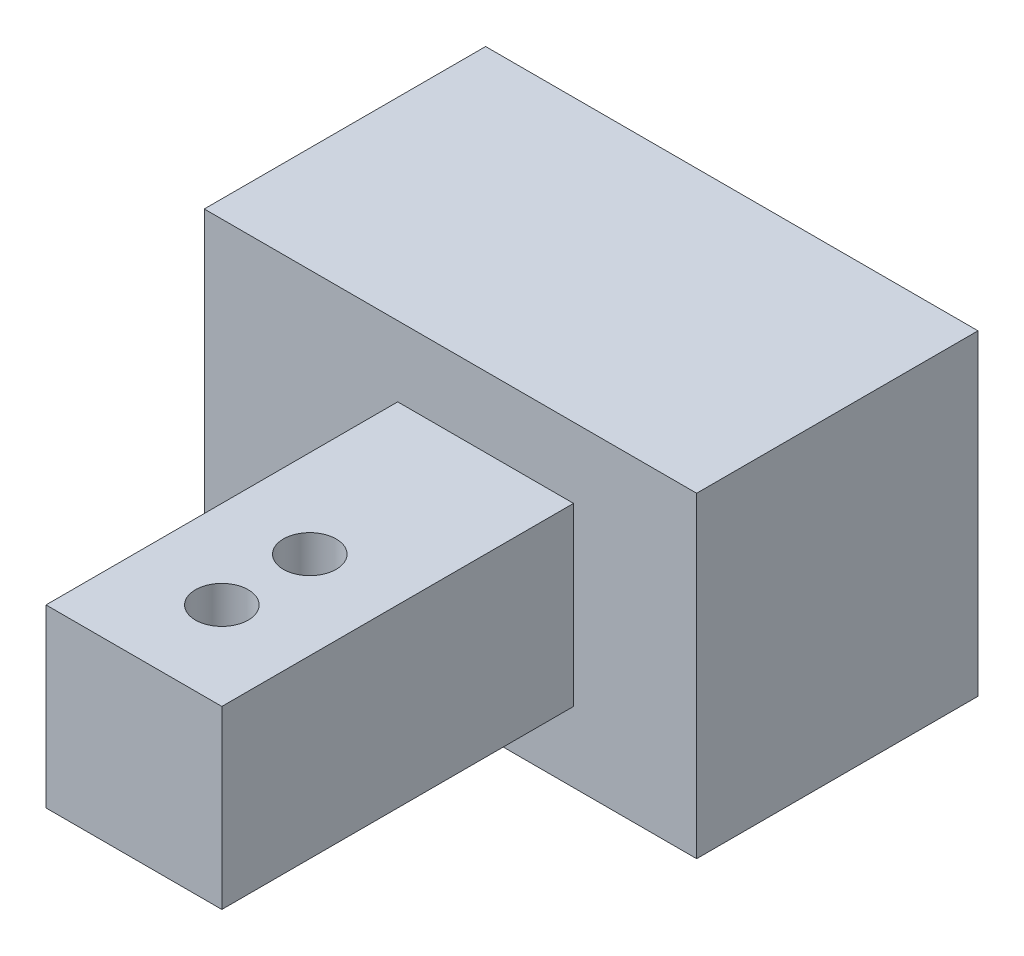
ISO-10303-21;
HEADER;
FILE_DESCRIPTION(('STEP AP214'),'2;1');
FILE_NAME('part.step','',(''),(''),'','','');
FILE_SCHEMA(('AUTOMOTIVE_DESIGN { 1 0 10303 214 1 1 1 1 }'));
ENDSEC;
DATA;
#1=APPLICATION_CONTEXT('core data for automotive mechanical design processes');
#2=APPLICATION_PROTOCOL_DEFINITION('international standard','automotive_design',2000,#1);
#3=PRODUCT_CONTEXT('',#1,'mechanical');
#4=PRODUCT('Part','Part','',(#3));
#5=PRODUCT_RELATED_PRODUCT_CATEGORY('part','',(#4));
#6=PRODUCT_DEFINITION_FORMATION('','',#4);
#7=PRODUCT_DEFINITION_CONTEXT('part definition',#1,'design');
#8=PRODUCT_DEFINITION('design','',#6,#7);
#9=PRODUCT_DEFINITION_SHAPE('','',#8);
#10=(LENGTH_UNIT() NAMED_UNIT(*) SI_UNIT(.MILLI.,.METRE.));
#11=(NAMED_UNIT(*) PLANE_ANGLE_UNIT() SI_UNIT($,.RADIAN.));
#12=(NAMED_UNIT(*) SI_UNIT($,.STERADIAN.) SOLID_ANGLE_UNIT());
#13=UNCERTAINTY_MEASURE_WITH_UNIT(LENGTH_MEASURE(1.E-05),#10,'distance_accuracy_value','');
#14=(GEOMETRIC_REPRESENTATION_CONTEXT(3) GLOBAL_UNCERTAINTY_ASSIGNED_CONTEXT((#13)) GLOBAL_UNIT_ASSIGNED_CONTEXT((#10,
#11,#12)) REPRESENTATION_CONTEXT('',''));
#15=CARTESIAN_POINT('',(0.,0.,0.));
#16=DIRECTION('',(0.,0.,1.));
#17=DIRECTION('',(1.,0.,0.));
#18=AXIS2_PLACEMENT_3D('',#15,#16,#17);
#19=CARTESIAN_POINT('',(-13.5384615384615,18.,10.6461538461538));
#20=DIRECTION('',(0.,0.,-1.));
#21=DIRECTION('',(-1.,0.,0.));
#22=AXIS2_PLACEMENT_3D('',#19,#20,#21);
#23=PLANE('',#22);
#24=DIRECTION('',(1.,0.,0.));
#25=VECTOR('',#24,1.);
#26=CARTESIAN_POINT('',(-13.5384615384615,0.,10.6461538461538));
#27=LINE('',#26,#25);
#28=CARTESIAN_POINT('',(-13.5384615384615,0.,10.6461538461538));
#29=VERTEX_POINT('',#28);
#30=CARTESIAN_POINT('',(14.4615384615385,0.,10.6461538461538));
#31=VERTEX_POINT('',#30);
#32=EDGE_CURVE('E216',#29,#31,#27,.T.);
#33=ORIENTED_EDGE('',*,*,#32,.T.);
#34=DIRECTION('',(0.,-1.,0.));
#35=VECTOR('',#34,1.);
#36=CARTESIAN_POINT('',(14.4615384615385,18.,10.6461538461538));
#37=LINE('',#36,#35);
#38=CARTESIAN_POINT('',(14.4615384615385,18.,10.6461538461538));
#39=VERTEX_POINT('',#38);
#40=EDGE_CURVE('E41',#39,#31,#37,.T.);
#41=ORIENTED_EDGE('',*,*,#40,.F.);
#42=DIRECTION('',(1.,0.,0.));
#43=VECTOR('',#42,1.);
#44=CARTESIAN_POINT('',(-13.5384615384615,18.,10.6461538461538));
#45=LINE('',#44,#43);
#46=CARTESIAN_POINT('',(-13.5384615384615,18.,10.6461538461538));
#47=VERTEX_POINT('',#46);
#48=EDGE_CURVE('E206',#47,#39,#45,.T.);
#49=ORIENTED_EDGE('',*,*,#48,.F.);
#50=DIRECTION('',(0.,-1.,0.));
#51=VECTOR('',#50,1.);
#52=CARTESIAN_POINT('',(-13.5384615384615,18.,10.6461538461538));
#53=LINE('',#52,#51);
#54=EDGE_CURVE('E11',#47,#29,#53,.T.);
#55=ORIENTED_EDGE('',*,*,#54,.T.);
#56=EDGE_LOOP('',(#33,#41,#49,#55));
#57=FACE_BOUND('',#56,.T.);
#58=DIRECTION('',(0.,-1.,0.));
#59=VECTOR('',#58,1.);
#60=CARTESIAN_POINT('',(-2.53846153846153,14.,10.6461538461538));
#61=LINE('',#60,#59);
#62=CARTESIAN_POINT('',(-2.53846153846153,14.,10.6461538461538));
#63=VERTEX_POINT('',#62);
#64=CARTESIAN_POINT('',(-2.53846153846153,4.,10.6461538461538));
#65=VERTEX_POINT('',#64);
#66=EDGE_CURVE('E172',#63,#65,#61,.T.);
#67=ORIENTED_EDGE('',*,*,#66,.F.);
#68=DIRECTION('',(-1.,0.,0.));
#69=VECTOR('',#68,1.);
#70=CARTESIAN_POINT('',(-2.53846153846153,14.,10.6461538461538));
#71=LINE('',#70,#69);
#72=CARTESIAN_POINT('',(7.46153846153847,14.,10.6461538461538));
#73=VERTEX_POINT('',#72);
#74=EDGE_CURVE('E177',#73,#63,#71,.T.);
#75=ORIENTED_EDGE('',*,*,#74,.F.);
#76=DIRECTION('',(0.,1.,0.));
#77=VECTOR('',#76,1.);
#78=CARTESIAN_POINT('',(7.46153846153847,14.,10.6461538461538));
#79=LINE('',#78,#77);
#80=CARTESIAN_POINT('',(7.46153846153847,4.,10.6461538461538));
#81=VERTEX_POINT('',#80);
#82=EDGE_CURVE('E187',#81,#73,#79,.T.);
#83=ORIENTED_EDGE('',*,*,#82,.F.);
#84=DIRECTION('',(1.,0.,0.));
#85=VECTOR('',#84,1.);
#86=CARTESIAN_POINT('',(-2.53846153846153,4.,10.6461538461538));
#87=LINE('',#86,#85);
#88=EDGE_CURVE('E56',#65,#81,#87,.T.);
#89=ORIENTED_EDGE('',*,*,#88,.F.);
#90=EDGE_LOOP('',(#67,#75,#83,#89));
#91=FACE_BOUND('',#90,.T.);
#92=ADVANCED_FACE('F33',(#57,#91),#23,.F.);
#93=CARTESIAN_POINT('',(-13.5384615384615,18.,-5.35384615384615));
#94=DIRECTION('',(1.,0.,0.));
#95=DIRECTION('',(0.,0.,-1.));
#96=AXIS2_PLACEMENT_3D('',#93,#94,#95);
#97=PLANE('',#96);
#98=DIRECTION('',(0.,0.,1.));
#99=VECTOR('',#98,1.);
#100=CARTESIAN_POINT('',(-13.5384615384615,2.,-3.35384615384615));
#101=LINE('',#100,#99);
#102=CARTESIAN_POINT('',(-13.5384615384615,2.,-3.35384615384615));
#103=VERTEX_POINT('',#102);
#104=CARTESIAN_POINT('',(-13.5384615384615,2.,8.64615384615385));
#105=VERTEX_POINT('',#104);
#106=EDGE_CURVE('E151',#103,#105,#101,.T.);
#107=ORIENTED_EDGE('',*,*,#106,.F.);
#108=DIRECTION('',(0.,-1.,0.));
#109=VECTOR('',#108,1.);
#110=CARTESIAN_POINT('',(-13.5384615384615,16.,-3.35384615384615));
#111=LINE('',#110,#109);
#112=CARTESIAN_POINT('',(-13.5384615384615,16.,-3.35384615384615));
#113=VERTEX_POINT('',#112);
#114=EDGE_CURVE('E48',#113,#103,#111,.T.);
#115=ORIENTED_EDGE('',*,*,#114,.F.);
#116=DIRECTION('',(0.,0.,-1.));
#117=VECTOR('',#116,1.);
#118=CARTESIAN_POINT('',(-13.5384615384615,16.,-3.35384615384615));
#119=LINE('',#118,#117);
#120=CARTESIAN_POINT('',(-13.5384615384615,16.,8.64615384615385));
#121=VERTEX_POINT('',#120);
#122=EDGE_CURVE('E142',#121,#113,#119,.T.);
#123=ORIENTED_EDGE('',*,*,#122,.F.);
#124=DIRECTION('',(0.,1.,0.));
#125=VECTOR('',#124,1.);
#126=CARTESIAN_POINT('',(-13.5384615384615,16.,8.64615384615385));
#127=LINE('',#126,#125);
#128=EDGE_CURVE('E145',#105,#121,#127,.T.);
#129=ORIENTED_EDGE('',*,*,#128,.F.);
#130=EDGE_LOOP('',(#107,#115,#123,#129));
#131=FACE_BOUND('',#130,.T.);
#132=DIRECTION('',(0.,0.,1.));
#133=VECTOR('',#132,1.);
#134=CARTESIAN_POINT('',(-13.5384615384615,0.,-5.35384615384615));
#135=LINE('',#134,#133);
#136=CARTESIAN_POINT('',(-13.5384615384615,0.,-5.35384615384615));
#137=VERTEX_POINT('',#136);
#138=EDGE_CURVE('E202',#137,#29,#135,.T.);
#139=ORIENTED_EDGE('',*,*,#138,.T.);
#140=ORIENTED_EDGE('',*,*,#54,.F.);
#141=DIRECTION('',(0.,0.,1.));
#142=VECTOR('',#141,1.);
#143=CARTESIAN_POINT('',(-13.5384615384615,18.,-5.35384615384615));
#144=LINE('',#143,#142);
#145=CARTESIAN_POINT('',(-13.5384615384615,18.,-5.35384615384615));
#146=VERTEX_POINT('',#145);
#147=EDGE_CURVE('E203',#146,#47,#144,.T.);
#148=ORIENTED_EDGE('',*,*,#147,.F.);
#149=DIRECTION('',(0.,-1.,0.));
#150=VECTOR('',#149,1.);
#151=CARTESIAN_POINT('',(-13.5384615384615,18.,-5.35384615384615));
#152=LINE('',#151,#150);
#153=EDGE_CURVE('E213',#146,#137,#152,.T.);
#154=ORIENTED_EDGE('',*,*,#153,.T.);
#155=EDGE_LOOP('',(#139,#140,#148,#154));
#156=FACE_BOUND('',#155,.T.);
#157=ADVANCED_FACE('F35',(#131,#156),#97,.F.);
#158=CARTESIAN_POINT('',(14.4615384615385,18.,-5.35384615384615));
#159=DIRECTION('',(-1.,0.,0.));
#160=DIRECTION('',(0.,0.,1.));
#161=AXIS2_PLACEMENT_3D('',#158,#159,#160);
#162=PLANE('',#161);
#163=DIRECTION('',(0.,0.,-1.));
#164=VECTOR('',#163,1.);
#165=CARTESIAN_POINT('',(14.4615384615385,0.,-5.35384615384615));
#166=LINE('',#165,#164);
#167=CARTESIAN_POINT('',(14.4615384615385,0.,-5.35384615384615));
#168=VERTEX_POINT('',#167);
#169=EDGE_CURVE('E218',#31,#168,#166,.T.);
#170=ORIENTED_EDGE('',*,*,#169,.T.);
#171=DIRECTION('',(0.,-1.,0.));
#172=VECTOR('',#171,1.);
#173=CARTESIAN_POINT('',(14.4615384615385,18.,-5.35384615384615));
#174=LINE('',#173,#172);
#175=CARTESIAN_POINT('',(14.4615384615385,18.,-5.35384615384615));
#176=VERTEX_POINT('',#175);
#177=EDGE_CURVE('E223',#176,#168,#174,.T.);
#178=ORIENTED_EDGE('',*,*,#177,.F.);
#179=DIRECTION('',(0.,0.,-1.));
#180=VECTOR('',#179,1.);
#181=CARTESIAN_POINT('',(14.4615384615385,18.,-5.35384615384615));
#182=LINE('',#181,#180);
#183=EDGE_CURVE('E209',#39,#176,#182,.T.);
#184=ORIENTED_EDGE('',*,*,#183,.F.);
#185=ORIENTED_EDGE('',*,*,#40,.T.);
#186=EDGE_LOOP('',(#170,#178,#184,#185));
#187=FACE_BOUND('',#186,.T.);
#188=ADVANCED_FACE('F230',(#187),#162,.F.);
#189=CARTESIAN_POINT('',(-13.5384615384615,18.,-5.35384615384615));
#190=DIRECTION('',(0.,0.,1.));
#191=DIRECTION('',(1.,0.,0.));
#192=AXIS2_PLACEMENT_3D('',#189,#190,#191);
#193=PLANE('',#192);
#194=DIRECTION('',(-1.,0.,0.));
#195=VECTOR('',#194,1.);
#196=CARTESIAN_POINT('',(-13.5384615384615,0.,-5.35384615384615));
#197=LINE('',#196,#195);
#198=EDGE_CURVE('E207',#168,#137,#197,.T.);
#199=ORIENTED_EDGE('',*,*,#198,.T.);
#200=ORIENTED_EDGE('',*,*,#153,.F.);
#201=DIRECTION('',(-1.,0.,0.));
#202=VECTOR('',#201,1.);
#203=CARTESIAN_POINT('',(-13.5384615384615,18.,-5.35384615384615));
#204=LINE('',#203,#202);
#205=EDGE_CURVE('E211',#176,#146,#204,.T.);
#206=ORIENTED_EDGE('',*,*,#205,.F.);
#207=ORIENTED_EDGE('',*,*,#177,.T.);
#208=EDGE_LOOP('',(#199,#200,#206,#207));
#209=FACE_BOUND('',#208,.T.);
#210=ADVANCED_FACE('F239',(#209),#193,.F.);
#211=CARTESIAN_POINT('',(0.,18.,0.));
#212=DIRECTION('',(0.,1.,0.));
#213=DIRECTION('',(0.,0.,1.));
#214=AXIS2_PLACEMENT_3D('',#211,#212,#213);
#215=PLANE('',#214);
#216=ORIENTED_EDGE('',*,*,#147,.T.);
#217=ORIENTED_EDGE('',*,*,#48,.T.);
#218=ORIENTED_EDGE('',*,*,#183,.T.);
#219=ORIENTED_EDGE('',*,*,#205,.T.);
#220=EDGE_LOOP('',(#216,#217,#218,#219));
#221=FACE_BOUND('',#220,.T.);
#222=ADVANCED_FACE('F245',(#221),#215,.T.);
#223=CARTESIAN_POINT('',(0.,0.,0.));
#224=DIRECTION('',(0.,1.,0.));
#225=DIRECTION('',(0.,0.,1.));
#226=AXIS2_PLACEMENT_3D('',#223,#224,#225);
#227=PLANE('',#226);
#228=ORIENTED_EDGE('',*,*,#138,.F.);
#229=ORIENTED_EDGE('',*,*,#198,.F.);
#230=ORIENTED_EDGE('',*,*,#169,.F.);
#231=ORIENTED_EDGE('',*,*,#32,.F.);
#232=EDGE_LOOP('',(#228,#229,#230,#231));
#233=FACE_BOUND('',#232,.T.);
#234=ADVANCED_FACE('F236',(#233),#227,.F.);
#235=CARTESIAN_POINT('',(-2.53846153846153,14.,30.6461538461539));
#236=DIRECTION('',(1.,0.,0.));
#237=DIRECTION('',(0.,1.,0.));
#238=AXIS2_PLACEMENT_3D('',#235,#236,#237);
#239=PLANE('',#238);
#240=ORIENTED_EDGE('',*,*,#66,.T.);
#241=DIRECTION('',(0.,0.,-1.));
#242=VECTOR('',#241,1.);
#243=CARTESIAN_POINT('',(-2.53846153846153,4.,30.6461538461539));
#244=LINE('',#243,#242);
#245=CARTESIAN_POINT('',(-2.53846153846153,4.,30.6461538461539));
#246=VERTEX_POINT('',#245);
#247=EDGE_CURVE('E200',#246,#65,#244,.T.);
#248=ORIENTED_EDGE('',*,*,#247,.F.);
#249=DIRECTION('',(0.,-1.,0.));
#250=VECTOR('',#249,1.);
#251=CARTESIAN_POINT('',(-2.53846153846153,14.,30.6461538461539));
#252=LINE('',#251,#250);
#253=CARTESIAN_POINT('',(-2.53846153846153,14.,30.6461538461539));
#254=VERTEX_POINT('',#253);
#255=EDGE_CURVE('E173',#254,#246,#252,.T.);
#256=ORIENTED_EDGE('',*,*,#255,.F.);
#257=DIRECTION('',(0.,0.,-1.));
#258=VECTOR('',#257,1.);
#259=CARTESIAN_POINT('',(-2.53846153846153,14.,30.6461538461539));
#260=LINE('',#259,#258);
#261=EDGE_CURVE('E183',#254,#63,#260,.T.);
#262=ORIENTED_EDGE('',*,*,#261,.T.);
#263=EDGE_LOOP('',(#240,#248,#256,#262));
#264=FACE_BOUND('',#263,.T.);
#265=ADVANCED_FACE('F255',(#264),#239,.F.);
#266=CARTESIAN_POINT('',(-2.53846153846153,4.,30.6461538461539));
#267=DIRECTION('',(0.,1.,0.));
#268=DIRECTION('',(0.,0.,1.));
#269=AXIS2_PLACEMENT_3D('',#266,#267,#268);
#270=PLANE('',#269);
#271=CARTESIAN_POINT('',(2.46153846153847,4.,25.6461538461539));
#272=DIRECTION('',(0.,1.,0.));
#273=DIRECTION('',(0.,0.,1.));
#274=AXIS2_PLACEMENT_3D('',#271,#272,#273);
#275=CIRCLE('',#274,1.5);
#276=CARTESIAN_POINT('',(2.46153846153847,4.,27.1461538461539));
#277=VERTEX_POINT('',#276);
#278=EDGE_CURVE('E163',#277,#277,#275,.T.);
#279=ORIENTED_EDGE('',*,*,#278,.T.);
#280=EDGE_LOOP('',(#279));
#281=FACE_BOUND('',#280,.T.);
#282=CARTESIAN_POINT('',(2.46153846153847,4.,20.6461538461538));
#283=DIRECTION('',(0.,1.,0.));
#284=DIRECTION('',(0.,0.,1.));
#285=AXIS2_PLACEMENT_3D('',#282,#283,#284);
#286=CIRCLE('',#285,1.5);
#287=CARTESIAN_POINT('',(2.46153846153847,4.,22.1461538461539));
#288=VERTEX_POINT('',#287);
#289=EDGE_CURVE('E169',#288,#288,#286,.T.);
#290=ORIENTED_EDGE('',*,*,#289,.T.);
#291=EDGE_LOOP('',(#290));
#292=FACE_BOUND('',#291,.T.);
#293=ORIENTED_EDGE('',*,*,#88,.T.);
#294=DIRECTION('',(0.,0.,-1.));
#295=VECTOR('',#294,1.);
#296=CARTESIAN_POINT('',(7.46153846153847,4.,30.6461538461539));
#297=LINE('',#296,#295);
#298=CARTESIAN_POINT('',(7.46153846153847,4.,30.6461538461539));
#299=VERTEX_POINT('',#298);
#300=EDGE_CURVE('E197',#299,#81,#297,.T.);
#301=ORIENTED_EDGE('',*,*,#300,.F.);
#302=DIRECTION('',(1.,0.,0.));
#303=VECTOR('',#302,1.);
#304=CARTESIAN_POINT('',(-2.53846153846153,4.,30.6461538461539));
#305=LINE('',#304,#303);
#306=EDGE_CURVE('E176',#246,#299,#305,.T.);
#307=ORIENTED_EDGE('',*,*,#306,.F.);
#308=ORIENTED_EDGE('',*,*,#247,.T.);
#309=EDGE_LOOP('',(#293,#301,#307,#308));
#310=FACE_BOUND('',#309,.T.);
#311=ADVANCED_FACE('F263',(#281,#292,#310),#270,.F.);
#312=CARTESIAN_POINT('',(7.46153846153847,14.,30.6461538461539));
#313=DIRECTION('',(-1.,0.,0.));
#314=DIRECTION('',(0.,-1.,0.));
#315=AXIS2_PLACEMENT_3D('',#312,#313,#314);
#316=PLANE('',#315);
#317=ORIENTED_EDGE('',*,*,#82,.T.);
#318=DIRECTION('',(0.,0.,-1.));
#319=VECTOR('',#318,1.);
#320=CARTESIAN_POINT('',(7.46153846153847,14.,30.6461538461539));
#321=LINE('',#320,#319);
#322=CARTESIAN_POINT('',(7.46153846153847,14.,30.6461538461539));
#323=VERTEX_POINT('',#322);
#324=EDGE_CURVE('E194',#323,#73,#321,.T.);
#325=ORIENTED_EDGE('',*,*,#324,.F.);
#326=DIRECTION('',(0.,1.,0.));
#327=VECTOR('',#326,1.);
#328=CARTESIAN_POINT('',(7.46153846153847,14.,30.6461538461539));
#329=LINE('',#328,#327);
#330=EDGE_CURVE('E179',#299,#323,#329,.T.);
#331=ORIENTED_EDGE('',*,*,#330,.F.);
#332=ORIENTED_EDGE('',*,*,#300,.T.);
#333=EDGE_LOOP('',(#317,#325,#331,#332));
#334=FACE_BOUND('',#333,.T.);
#335=ADVANCED_FACE('F261',(#334),#316,.F.);
#336=CARTESIAN_POINT('',(-2.53846153846153,14.,30.6461538461539));
#337=DIRECTION('',(0.,-1.,0.));
#338=DIRECTION('',(0.,0.,-1.));
#339=AXIS2_PLACEMENT_3D('',#336,#337,#338);
#340=PLANE('',#339);
#341=CARTESIAN_POINT('',(2.46153846153847,14.,25.6461538461539));
#342=DIRECTION('',(0.,1.,0.));
#343=DIRECTION('',(0.,0.,1.));
#344=AXIS2_PLACEMENT_3D('',#341,#342,#343);
#345=CIRCLE('',#344,1.5);
#346=CARTESIAN_POINT('',(2.46153846153847,14.,27.1461538461539));
#347=VERTEX_POINT('',#346);
#348=EDGE_CURVE('E157',#347,#347,#345,.T.);
#349=ORIENTED_EDGE('',*,*,#348,.F.);
#350=EDGE_LOOP('',(#349));
#351=FACE_BOUND('',#350,.T.);
#352=CARTESIAN_POINT('',(2.46153846153847,14.,20.6461538461538));
#353=DIRECTION('',(0.,1.,0.));
#354=DIRECTION('',(0.,0.,1.));
#355=AXIS2_PLACEMENT_3D('',#352,#353,#354);
#356=CIRCLE('',#355,1.5);
#357=CARTESIAN_POINT('',(2.46153846153847,14.,22.1461538461539));
#358=VERTEX_POINT('',#357);
#359=EDGE_CURVE('E166',#358,#358,#356,.T.);
#360=ORIENTED_EDGE('',*,*,#359,.F.);
#361=EDGE_LOOP('',(#360));
#362=FACE_BOUND('',#361,.T.);
#363=ORIENTED_EDGE('',*,*,#74,.T.);
#364=ORIENTED_EDGE('',*,*,#261,.F.);
#365=DIRECTION('',(-1.,0.,0.));
#366=VECTOR('',#365,1.);
#367=CARTESIAN_POINT('',(-2.53846153846153,14.,30.6461538461539));
#368=LINE('',#367,#366);
#369=EDGE_CURVE('E181',#323,#254,#368,.T.);
#370=ORIENTED_EDGE('',*,*,#369,.F.);
#371=ORIENTED_EDGE('',*,*,#324,.T.);
#372=EDGE_LOOP('',(#363,#364,#370,#371));
#373=FACE_BOUND('',#372,.T.);
#374=ADVANCED_FACE('F251',(#351,#362,#373),#340,.F.);
#375=CARTESIAN_POINT('',(0.,0.,30.6461538461539));
#376=DIRECTION('',(0.,0.,1.));
#377=DIRECTION('',(1.,0.,0.));
#378=AXIS2_PLACEMENT_3D('',#375,#376,#377);
#379=PLANE('',#378);
#380=ORIENTED_EDGE('',*,*,#255,.T.);
#381=ORIENTED_EDGE('',*,*,#306,.T.);
#382=ORIENTED_EDGE('',*,*,#330,.T.);
#383=ORIENTED_EDGE('',*,*,#369,.T.);
#384=EDGE_LOOP('',(#380,#381,#382,#383));
#385=FACE_BOUND('',#384,.T.);
#386=ADVANCED_FACE('F257',(#385),#379,.T.);
#387=CARTESIAN_POINT('',(2.46153846153847,-6.,20.6461538461538));
#388=DIRECTION('',(0.,1.,0.));
#389=DIRECTION('',(0.,0.,1.));
#390=AXIS2_PLACEMENT_3D('',#387,#388,#389);
#391=CYLINDRICAL_SURFACE('',#390,1.5);
#392=ORIENTED_EDGE('',*,*,#359,.T.);
#393=EDGE_LOOP('',(#392));
#394=FACE_BOUND('',#393,.T.);
#395=ORIENTED_EDGE('',*,*,#289,.F.);
#396=EDGE_LOOP('',(#395));
#397=FACE_BOUND('',#396,.T.);
#398=ADVANCED_FACE('F310',(#394,#397),#391,.F.);
#399=CARTESIAN_POINT('',(2.46153846153847,-6.,25.6461538461539));
#400=DIRECTION('',(0.,1.,0.));
#401=DIRECTION('',(0.,0.,1.));
#402=AXIS2_PLACEMENT_3D('',#399,#400,#401);
#403=CYLINDRICAL_SURFACE('',#402,1.5);
#404=ORIENTED_EDGE('',*,*,#348,.T.);
#405=EDGE_LOOP('',(#404));
#406=FACE_BOUND('',#405,.T.);
#407=ORIENTED_EDGE('',*,*,#278,.F.);
#408=EDGE_LOOP('',(#407));
#409=FACE_BOUND('',#408,.T.);
#410=ADVANCED_FACE('F302',(#406,#409),#403,.F.);
#411=CARTESIAN_POINT('',(12.4615384615385,16.,-3.35384615384615));
#412=DIRECTION('',(0.,0.,-1.));
#413=DIRECTION('',(0.,1.,0.));
#414=AXIS2_PLACEMENT_3D('',#411,#412,#413);
#415=PLANE('',#414);
#416=ORIENTED_EDGE('',*,*,#114,.T.);
#417=DIRECTION('',(-1.,0.,0.));
#418=VECTOR('',#417,1.);
#419=CARTESIAN_POINT('',(12.4615384615385,2.,-3.35384615384615));
#420=LINE('',#419,#418);
#421=CARTESIAN_POINT('',(12.4615384615385,2.,-3.35384615384615));
#422=VERTEX_POINT('',#421);
#423=EDGE_CURVE('E120',#422,#103,#420,.T.);
#424=ORIENTED_EDGE('',*,*,#423,.F.);
#425=DIRECTION('',(0.,-1.,0.));
#426=VECTOR('',#425,1.);
#427=CARTESIAN_POINT('',(12.4615384615385,16.,-3.35384615384615));
#428=LINE('',#427,#426);
#429=CARTESIAN_POINT('',(12.4615384615385,16.,-3.35384615384615));
#430=VERTEX_POINT('',#429);
#431=EDGE_CURVE('E124',#430,#422,#428,.T.);
#432=ORIENTED_EDGE('',*,*,#431,.F.);
#433=DIRECTION('',(-1.,0.,0.));
#434=VECTOR('',#433,1.);
#435=CARTESIAN_POINT('',(12.4615384615385,16.,-3.35384615384615));
#436=LINE('',#435,#434);
#437=EDGE_CURVE('E155',#430,#113,#436,.T.);
#438=ORIENTED_EDGE('',*,*,#437,.T.);
#439=EDGE_LOOP('',(#416,#424,#432,#438));
#440=FACE_BOUND('',#439,.T.);
#441=ADVANCED_FACE('F122',(#440),#415,.F.);
#442=CARTESIAN_POINT('',(12.4615384615385,16.,-3.35384615384615));
#443=DIRECTION('',(0.,1.,0.));
#444=DIRECTION('',(0.,0.,1.));
#445=AXIS2_PLACEMENT_3D('',#442,#443,#444);
#446=PLANE('',#445);
#447=ORIENTED_EDGE('',*,*,#122,.T.);
#448=ORIENTED_EDGE('',*,*,#437,.F.);
#449=DIRECTION('',(0.,0.,-1.));
#450=VECTOR('',#449,1.);
#451=CARTESIAN_POINT('',(12.4615384615385,16.,-3.35384615384615));
#452=LINE('',#451,#450);
#453=CARTESIAN_POINT('',(12.4615384615385,16.,8.64615384615385));
#454=VERTEX_POINT('',#453);
#455=EDGE_CURVE('E130',#454,#430,#452,.T.);
#456=ORIENTED_EDGE('',*,*,#455,.F.);
#457=DIRECTION('',(-1.,0.,0.));
#458=VECTOR('',#457,1.);
#459=CARTESIAN_POINT('',(12.4615384615385,16.,8.64615384615385));
#460=LINE('',#459,#458);
#461=EDGE_CURVE('E158',#454,#121,#460,.T.);
#462=ORIENTED_EDGE('',*,*,#461,.T.);
#463=EDGE_LOOP('',(#447,#448,#456,#462));
#464=FACE_BOUND('',#463,.T.);
#465=ADVANCED_FACE('F294',(#464),#446,.F.);
#466=CARTESIAN_POINT('',(12.4615384615385,16.,8.64615384615385));
#467=DIRECTION('',(0.,0.,1.));
#468=DIRECTION('',(0.,-1.,0.));
#469=AXIS2_PLACEMENT_3D('',#466,#467,#468);
#470=PLANE('',#469);
#471=ORIENTED_EDGE('',*,*,#128,.T.);
#472=ORIENTED_EDGE('',*,*,#461,.F.);
#473=DIRECTION('',(0.,1.,0.));
#474=VECTOR('',#473,1.);
#475=CARTESIAN_POINT('',(12.4615384615385,16.,8.64615384615385));
#476=LINE('',#475,#474);
#477=CARTESIAN_POINT('',(12.4615384615385,2.,8.64615384615385));
#478=VERTEX_POINT('',#477);
#479=EDGE_CURVE('E138',#478,#454,#476,.T.);
#480=ORIENTED_EDGE('',*,*,#479,.F.);
#481=DIRECTION('',(-1.,0.,0.));
#482=VECTOR('',#481,1.);
#483=CARTESIAN_POINT('',(12.4615384615385,2.,8.64615384615385));
#484=LINE('',#483,#482);
#485=EDGE_CURVE('E129',#478,#105,#484,.T.);
#486=ORIENTED_EDGE('',*,*,#485,.T.);
#487=EDGE_LOOP('',(#471,#472,#480,#486));
#488=FACE_BOUND('',#487,.T.);
#489=ADVANCED_FACE('F292',(#488),#470,.F.);
#490=CARTESIAN_POINT('',(12.4615384615385,2.,-3.35384615384615));
#491=DIRECTION('',(0.,-1.,0.));
#492=DIRECTION('',(0.,0.,-1.));
#493=AXIS2_PLACEMENT_3D('',#490,#491,#492);
#494=PLANE('',#493);
#495=ORIENTED_EDGE('',*,*,#106,.T.);
#496=ORIENTED_EDGE('',*,*,#485,.F.);
#497=DIRECTION('',(0.,0.,1.));
#498=VECTOR('',#497,1.);
#499=CARTESIAN_POINT('',(12.4615384615385,2.,-3.35384615384615));
#500=LINE('',#499,#498);
#501=EDGE_CURVE('E133',#422,#478,#500,.T.);
#502=ORIENTED_EDGE('',*,*,#501,.F.);
#503=ORIENTED_EDGE('',*,*,#423,.T.);
#504=EDGE_LOOP('',(#495,#496,#502,#503));
#505=FACE_BOUND('',#504,.T.);
#506=ADVANCED_FACE('F134',(#505),#494,.F.);
#507=CARTESIAN_POINT('',(12.4615384615385,0.,0.));
#508=DIRECTION('',(-1.,0.,0.));
#509=DIRECTION('',(0.,0.,1.));
#510=AXIS2_PLACEMENT_3D('',#507,#508,#509);
#511=PLANE('',#510);
#512=ORIENTED_EDGE('',*,*,#431,.T.);
#513=ORIENTED_EDGE('',*,*,#501,.T.);
#514=ORIENTED_EDGE('',*,*,#479,.T.);
#515=ORIENTED_EDGE('',*,*,#455,.T.);
#516=EDGE_LOOP('',(#512,#513,#514,#515));
#517=FACE_BOUND('',#516,.T.);
#518=ADVANCED_FACE('F140',(#517),#511,.T.);
#519=CLOSED_SHELL('',(#92,#157,#188,#210,#222,#234,#265,#311,#335,#374,#386,#398,#410,#441,#465,
#489,#506,#518));
#520=MANIFOLD_SOLID_BREP('B2',#519);
#521=ADVANCED_BREP_SHAPE_REPRESENTATION('',(#18,#520),#14);
#522=SHAPE_DEFINITION_REPRESENTATION(#9,#521);
ENDSEC;
END-ISO-10303-21;
